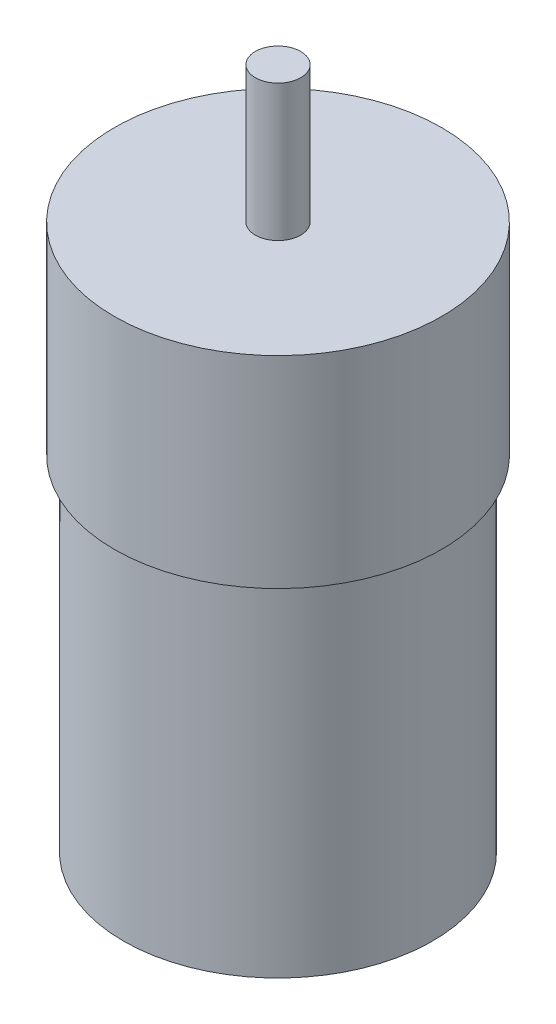
ISO-10303-21;
HEADER;
FILE_DESCRIPTION(('STEP AP214'),'2;1');
FILE_NAME('part.step','',(''),(''),'','','');
FILE_SCHEMA(('AUTOMOTIVE_DESIGN { 1 0 10303 214 1 1 1 1 }'));
ENDSEC;
DATA;
#1=APPLICATION_CONTEXT('core data for automotive mechanical design processes');
#2=APPLICATION_PROTOCOL_DEFINITION('international standard','automotive_design',2000,#1);
#3=PRODUCT_CONTEXT('',#1,'mechanical');
#4=PRODUCT('Part','Part','',(#3));
#5=PRODUCT_RELATED_PRODUCT_CATEGORY('part','',(#4));
#6=PRODUCT_DEFINITION_FORMATION('','',#4);
#7=PRODUCT_DEFINITION_CONTEXT('part definition',#1,'design');
#8=PRODUCT_DEFINITION('design','',#6,#7);
#9=PRODUCT_DEFINITION_SHAPE('','',#8);
#10=(LENGTH_UNIT() NAMED_UNIT(*) SI_UNIT(.MILLI.,.METRE.));
#11=(NAMED_UNIT(*) PLANE_ANGLE_UNIT() SI_UNIT($,.RADIAN.));
#12=(NAMED_UNIT(*) SI_UNIT($,.STERADIAN.) SOLID_ANGLE_UNIT());
#13=UNCERTAINTY_MEASURE_WITH_UNIT(LENGTH_MEASURE(1.E-05),#10,'distance_accuracy_value','');
#14=(GEOMETRIC_REPRESENTATION_CONTEXT(3) GLOBAL_UNCERTAINTY_ASSIGNED_CONTEXT((#13)) GLOBAL_UNIT_ASSIGNED_CONTEXT((#10,
#11,#12)) REPRESENTATION_CONTEXT('',''));
#15=CARTESIAN_POINT('',(0.,0.,0.));
#16=DIRECTION('',(0.,0.,1.));
#17=DIRECTION('',(1.,0.,0.));
#18=AXIS2_PLACEMENT_3D('',#15,#16,#17);
#19=CARTESIAN_POINT('',(2.5,15.,0.));
#20=DIRECTION('',(0.,-1.,0.));
#21=DIRECTION('',(0.,0.,-1.));
#22=AXIS2_PLACEMENT_3D('',#19,#20,#21);
#23=PLANE('',#22);
#24=CARTESIAN_POINT('',(0.,15.,0.));
#25=DIRECTION('',(0.,1.,0.));
#26=DIRECTION('',(0.,0.,1.));
#27=AXIS2_PLACEMENT_3D('',#24,#25,#26);
#28=CIRCLE('',#27,2.5);
#29=CARTESIAN_POINT('',(0.,15.,2.5));
#30=VERTEX_POINT('',#29);
#31=EDGE_CURVE('E53',#30,#30,#28,.T.);
#32=ORIENTED_EDGE('',*,*,#31,.T.);
#33=EDGE_LOOP('',(#32));
#34=FACE_BOUND('',#33,.T.);
#35=ADVANCED_FACE('F31',(#34),#23,.F.);
#36=CARTESIAN_POINT('',(0.,-60.,0.));
#37=DIRECTION('',(0.,1.,0.));
#38=DIRECTION('',(0.,0.,1.));
#39=AXIS2_PLACEMENT_3D('',#36,#37,#38);
#40=PLANE('',#39);
#41=CARTESIAN_POINT('',(0.,-60.,0.));
#42=DIRECTION('',(0.,1.,0.));
#43=DIRECTION('',(0.,0.,1.));
#44=AXIS2_PLACEMENT_3D('',#41,#42,#43);
#45=CIRCLE('',#44,17.);
#46=CARTESIAN_POINT('',(0.,-60.,17.));
#47=VERTEX_POINT('',#46);
#48=EDGE_CURVE('E10',#47,#47,#45,.T.);
#49=ORIENTED_EDGE('',*,*,#48,.F.);
#50=EDGE_LOOP('',(#49));
#51=FACE_BOUND('',#50,.T.);
#52=ADVANCED_FACE('F83',(#51),#40,.F.);
#53=CARTESIAN_POINT('',(0.,55.3821832133679,0.));
#54=DIRECTION('',(0.,1.,0.));
#55=DIRECTION('',(0.,0.,1.));
#56=AXIS2_PLACEMENT_3D('',#53,#54,#55);
#57=CYLINDRICAL_SURFACE('',#56,17.);
#58=CARTESIAN_POINT('',(0.,-22.1917808219178,0.));
#59=DIRECTION('',(0.,1.,0.));
#60=DIRECTION('',(0.,0.,1.));
#61=AXIS2_PLACEMENT_3D('',#58,#59,#60);
#62=CIRCLE('',#61,17.);
#63=CARTESIAN_POINT('',(0.,-22.1917808219178,17.));
#64=VERTEX_POINT('',#63);
#65=EDGE_CURVE('E37',#64,#64,#62,.T.);
#66=ORIENTED_EDGE('',*,*,#65,.F.);
#67=EDGE_LOOP('',(#66));
#68=FACE_BOUND('',#67,.T.);
#69=ORIENTED_EDGE('',*,*,#48,.T.);
#70=EDGE_LOOP('',(#69));
#71=FACE_BOUND('',#70,.T.);
#72=ADVANCED_FACE('F78',(#68,#71),#57,.T.);
#73=CARTESIAN_POINT('',(17.,-22.1917808219178,0.));
#74=DIRECTION('',(0.,1.,0.));
#75=DIRECTION('',(0.,0.,1.));
#76=AXIS2_PLACEMENT_3D('',#73,#74,#75);
#77=PLANE('',#76);
#78=CARTESIAN_POINT('',(0.,-22.1917808219178,0.));
#79=DIRECTION('',(0.,1.,0.));
#80=DIRECTION('',(0.,0.,1.));
#81=AXIS2_PLACEMENT_3D('',#78,#79,#80);
#82=CIRCLE('',#81,18.);
#83=CARTESIAN_POINT('',(0.,-22.1917808219178,18.));
#84=VERTEX_POINT('',#83);
#85=EDGE_CURVE('E41',#84,#84,#82,.T.);
#86=ORIENTED_EDGE('',*,*,#85,.F.);
#87=EDGE_LOOP('',(#86));
#88=FACE_BOUND('',#87,.T.);
#89=ORIENTED_EDGE('',*,*,#65,.T.);
#90=EDGE_LOOP('',(#89));
#91=FACE_BOUND('',#90,.T.);
#92=ADVANCED_FACE('F73',(#88,#91),#77,.F.);
#93=CARTESIAN_POINT('',(0.,55.3821832133679,0.));
#94=DIRECTION('',(0.,1.,0.));
#95=DIRECTION('',(0.,0.,1.));
#96=AXIS2_PLACEMENT_3D('',#93,#94,#95);
#97=CYLINDRICAL_SURFACE('',#96,18.);
#98=CARTESIAN_POINT('',(0.,0.,0.));
#99=DIRECTION('',(0.,1.,0.));
#100=DIRECTION('',(0.,0.,1.));
#101=AXIS2_PLACEMENT_3D('',#98,#99,#100);
#102=CIRCLE('',#101,18.);
#103=CARTESIAN_POINT('',(0.,0.,18.));
#104=VERTEX_POINT('',#103);
#105=EDGE_CURVE('E45',#104,#104,#102,.T.);
#106=ORIENTED_EDGE('',*,*,#105,.F.);
#107=EDGE_LOOP('',(#106));
#108=FACE_BOUND('',#107,.T.);
#109=ORIENTED_EDGE('',*,*,#85,.T.);
#110=EDGE_LOOP('',(#109));
#111=FACE_BOUND('',#110,.T.);
#112=ADVANCED_FACE('F67',(#108,#111),#97,.T.);
#113=CARTESIAN_POINT('',(18.,0.,0.));
#114=DIRECTION('',(0.,-1.,0.));
#115=DIRECTION('',(0.,0.,-1.));
#116=AXIS2_PLACEMENT_3D('',#113,#114,#115);
#117=PLANE('',#116);
#118=CARTESIAN_POINT('',(0.,0.,0.));
#119=DIRECTION('',(0.,1.,0.));
#120=DIRECTION('',(0.,0.,1.));
#121=AXIS2_PLACEMENT_3D('',#118,#119,#120);
#122=CIRCLE('',#121,2.5);
#123=CARTESIAN_POINT('',(0.,0.,2.5));
#124=VERTEX_POINT('',#123);
#125=EDGE_CURVE('E50',#124,#124,#122,.T.);
#126=ORIENTED_EDGE('',*,*,#125,.F.);
#127=EDGE_LOOP('',(#126));
#128=FACE_BOUND('',#127,.T.);
#129=ORIENTED_EDGE('',*,*,#105,.T.);
#130=EDGE_LOOP('',(#129));
#131=FACE_BOUND('',#130,.T.);
#132=ADVANCED_FACE('F61',(#128,#131),#117,.F.);
#133=CARTESIAN_POINT('',(0.,55.3821832133679,0.));
#134=DIRECTION('',(0.,1.,0.));
#135=DIRECTION('',(0.,0.,1.));
#136=AXIS2_PLACEMENT_3D('',#133,#134,#135);
#137=CYLINDRICAL_SURFACE('',#136,2.5);
#138=ORIENTED_EDGE('',*,*,#31,.F.);
#139=EDGE_LOOP('',(#138));
#140=FACE_BOUND('',#139,.T.);
#141=ORIENTED_EDGE('',*,*,#125,.T.);
#142=EDGE_LOOP('',(#141));
#143=FACE_BOUND('',#142,.T.);
#144=ADVANCED_FACE('F58',(#140,#143),#137,.T.);
#145=CLOSED_SHELL('',(#35,#52,#72,#92,#112,#132,#144));
#146=MANIFOLD_SOLID_BREP('B2',#145);
#147=ADVANCED_BREP_SHAPE_REPRESENTATION('',(#18,#146),#14);
#148=SHAPE_DEFINITION_REPRESENTATION(#9,#147);
ENDSEC;
END-ISO-10303-21;
